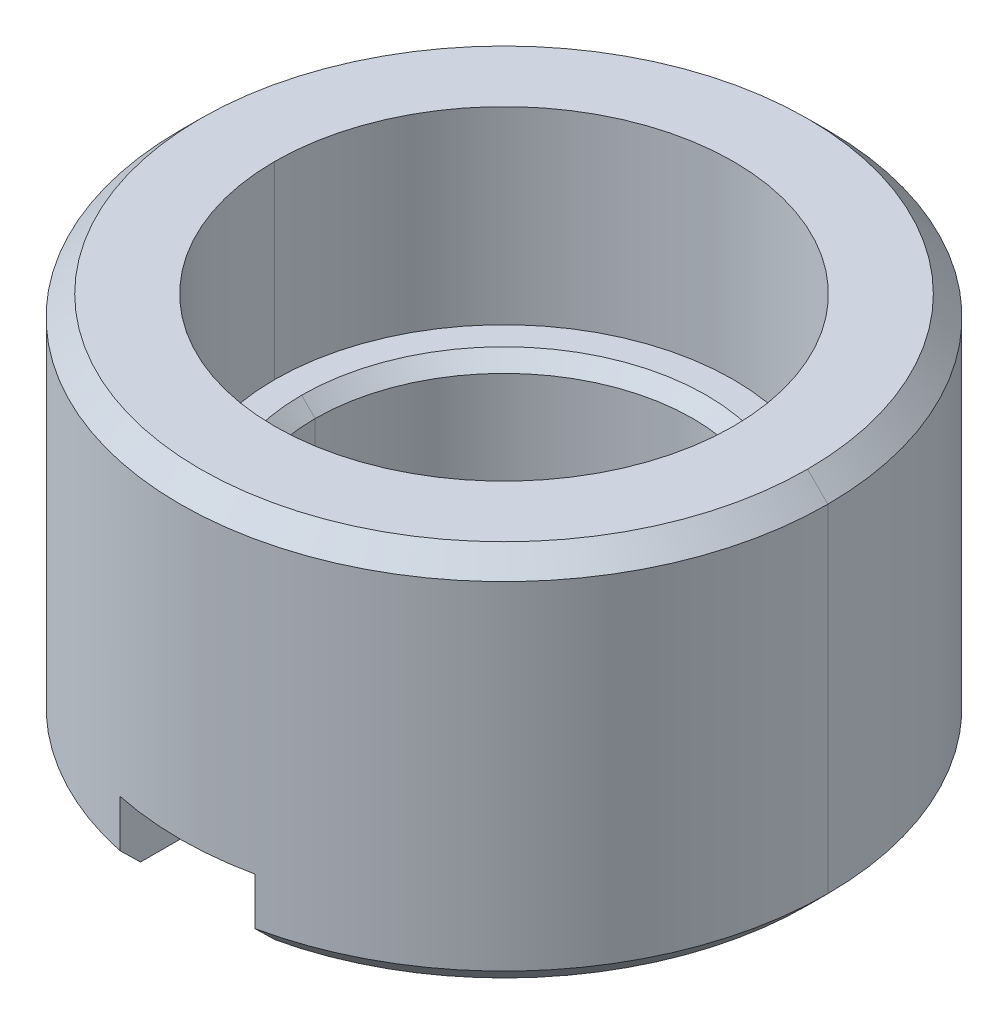
ISO-10303-21;
HEADER;
FILE_DESCRIPTION(('STEP AP214'),'2;1');
FILE_NAME('part.step','',(''),(''),'','','');
FILE_SCHEMA(('AUTOMOTIVE_DESIGN { 1 0 10303 214 1 1 1 1 }'));
ENDSEC;
DATA;
#1=APPLICATION_CONTEXT('core data for automotive mechanical design processes');
#2=APPLICATION_PROTOCOL_DEFINITION('international standard','automotive_design',2000,#1);
#3=PRODUCT_CONTEXT('',#1,'mechanical');
#4=PRODUCT('Part','Part','',(#3));
#5=PRODUCT_RELATED_PRODUCT_CATEGORY('part','',(#4));
#6=PRODUCT_DEFINITION_FORMATION('','',#4);
#7=PRODUCT_DEFINITION_CONTEXT('part definition',#1,'design');
#8=PRODUCT_DEFINITION('design','',#6,#7);
#9=PRODUCT_DEFINITION_SHAPE('','',#8);
#10=(LENGTH_UNIT() NAMED_UNIT(*) SI_UNIT(.MILLI.,.METRE.));
#11=(NAMED_UNIT(*) PLANE_ANGLE_UNIT() SI_UNIT($,.RADIAN.));
#12=(NAMED_UNIT(*) SI_UNIT($,.STERADIAN.) SOLID_ANGLE_UNIT());
#13=UNCERTAINTY_MEASURE_WITH_UNIT(LENGTH_MEASURE(1.E-05),#10,'distance_accuracy_value','');
#14=(GEOMETRIC_REPRESENTATION_CONTEXT(3) GLOBAL_UNCERTAINTY_ASSIGNED_CONTEXT((#13)) GLOBAL_UNIT_ASSIGNED_CONTEXT((#10,
#11,#12)) REPRESENTATION_CONTEXT('',''));
#15=CARTESIAN_POINT('',(0.,0.,0.));
#16=DIRECTION('',(0.,0.,1.));
#17=DIRECTION('',(1.,0.,0.));
#18=AXIS2_PLACEMENT_3D('',#15,#16,#17);
#19=CARTESIAN_POINT('',(0.,2.8,0.));
#20=DIRECTION('',(0.,-1.,0.));
#21=DIRECTION('',(1.,0.,0.));
#22=AXIS2_PLACEMENT_3D('',#19,#20,#21);
#23=CYLINDRICAL_SURFACE('',#22,1.7);
#24=CARTESIAN_POINT('',(0.,2.8,0.));
#25=DIRECTION('',(0.,1.,0.));
#26=DIRECTION('',(1.,0.,0.));
#27=AXIS2_PLACEMENT_3D('',#24,#25,#26);
#28=CIRCLE('',#27,1.7);
#29=CARTESIAN_POINT('',(1.7,2.8,0.));
#30=VERTEX_POINT('',#29);
#31=CARTESIAN_POINT('',(-1.7,2.8,0.));
#32=VERTEX_POINT('',#31);
#33=EDGE_CURVE('E203',#30,#32,#28,.T.);
#34=ORIENTED_EDGE('',*,*,#33,.T.);
#35=DIRECTION('',(0.,-1.,0.));
#36=VECTOR('',#35,1.);
#37=CARTESIAN_POINT('',(-1.7,2.8,0.));
#38=LINE('',#37,#36);
#39=CARTESIAN_POINT('',(-1.7,1.4,0.));
#40=VERTEX_POINT('',#39);
#41=EDGE_CURVE('E26',#32,#40,#38,.T.);
#42=ORIENTED_EDGE('',*,*,#41,.T.);
#43=CARTESIAN_POINT('',(0.,1.4,0.));
#44=DIRECTION('',(0.,-1.,0.));
#45=DIRECTION('',(-1.,0.,0.));
#46=AXIS2_PLACEMENT_3D('',#43,#44,#45);
#47=CIRCLE('',#46,1.7);
#48=CARTESIAN_POINT('',(1.7,1.4,0.));
#49=VERTEX_POINT('',#48);
#50=EDGE_CURVE('E265',#40,#49,#47,.T.);
#51=ORIENTED_EDGE('',*,*,#50,.T.);
#52=DIRECTION('',(0.,-1.,0.));
#53=VECTOR('',#52,1.);
#54=CARTESIAN_POINT('',(1.7,2.8,0.));
#55=LINE('',#54,#53);
#56=EDGE_CURVE('E11',#30,#49,#55,.T.);
#57=ORIENTED_EDGE('',*,*,#56,.F.);
#58=EDGE_LOOP('',(#34,#42,#51,#57));
#59=FACE_BOUND('',#58,.T.);
#60=ADVANCED_FACE('F17',(#59),#23,.F.);
#61=CARTESIAN_POINT('',(0.,2.8,0.));
#62=DIRECTION('',(0.,-1.,0.));
#63=DIRECTION('',(1.,0.,0.));
#64=AXIS2_PLACEMENT_3D('',#61,#62,#63);
#65=CYLINDRICAL_SURFACE('',#64,1.7);
#66=CARTESIAN_POINT('',(0.,1.4,0.));
#67=DIRECTION('',(0.,-1.,0.));
#68=DIRECTION('',(1.,0.,0.));
#69=AXIS2_PLACEMENT_3D('',#66,#67,#68);
#70=CIRCLE('',#69,1.7);
#71=EDGE_CURVE('E196',#49,#40,#70,.T.);
#72=ORIENTED_EDGE('',*,*,#71,.T.);
#73=ORIENTED_EDGE('',*,*,#41,.F.);
#74=CARTESIAN_POINT('',(0.,2.8,0.));
#75=DIRECTION('',(0.,1.,0.));
#76=DIRECTION('',(-1.,0.,0.));
#77=AXIS2_PLACEMENT_3D('',#74,#75,#76);
#78=CIRCLE('',#77,1.7);
#79=EDGE_CURVE('E194',#32,#30,#78,.T.);
#80=ORIENTED_EDGE('',*,*,#79,.T.);
#81=ORIENTED_EDGE('',*,*,#56,.T.);
#82=EDGE_LOOP('',(#72,#73,#80,#81));
#83=FACE_BOUND('',#82,.T.);
#84=ADVANCED_FACE('F193',(#83),#65,.F.);
#85=CARTESIAN_POINT('',(0.,1.4,0.));
#86=DIRECTION('',(0.,-1.,0.));
#87=DIRECTION('',(0.,0.,-1.));
#88=AXIS2_PLACEMENT_3D('',#85,#86,#87);
#89=PLANE('',#88);
#90=CARTESIAN_POINT('',(0.,1.4,0.));
#91=DIRECTION('',(0.,1.,0.));
#92=DIRECTION('',(0.,0.,1.));
#93=AXIS2_PLACEMENT_3D('',#90,#91,#92);
#94=CIRCLE('',#93,1.5);
#95=CARTESIAN_POINT('',(0.,1.4,1.5));
#96=VERTEX_POINT('',#95);
#97=CARTESIAN_POINT('',(1.5,1.4,9.085731393483E-11));
#98=VERTEX_POINT('',#97);
#99=EDGE_CURVE('E251',#96,#98,#94,.T.);
#100=ORIENTED_EDGE('',*,*,#99,.F.);
#101=CARTESIAN_POINT('',(0.,1.4,0.));
#102=DIRECTION('',(0.,1.,0.));
#103=DIRECTION('',(-1.,0.,0.));
#104=AXIS2_PLACEMENT_3D('',#101,#102,#103);
#105=CIRCLE('',#104,1.5);
#106=CARTESIAN_POINT('',(-1.5,1.4,0.));
#107=VERTEX_POINT('',#106);
#108=EDGE_CURVE('E247',#107,#96,#105,.T.);
#109=ORIENTED_EDGE('',*,*,#108,.F.);
#110=CARTESIAN_POINT('',(0.,1.4,0.));
#111=DIRECTION('',(0.,1.,0.));
#112=DIRECTION('',(0.,0.,-1.));
#113=AXIS2_PLACEMENT_3D('',#110,#111,#112);
#114=CIRCLE('',#113,1.5);
#115=CARTESIAN_POINT('',(0.,1.4,-1.5));
#116=VERTEX_POINT('',#115);
#117=EDGE_CURVE('E80',#116,#107,#114,.T.);
#118=ORIENTED_EDGE('',*,*,#117,.F.);
#119=CARTESIAN_POINT('',(0.,1.4,0.));
#120=DIRECTION('',(0.,1.,0.));
#121=DIRECTION('',(1.,0.,0.));
#122=AXIS2_PLACEMENT_3D('',#119,#120,#121);
#123=CIRCLE('',#122,1.5);
#124=EDGE_CURVE('E256',#98,#116,#123,.T.);
#125=ORIENTED_EDGE('',*,*,#124,.F.);
#126=EDGE_LOOP('',(#100,#109,#118,#125));
#127=FACE_BOUND('',#126,.T.);
#128=ORIENTED_EDGE('',*,*,#50,.F.);
#129=ORIENTED_EDGE('',*,*,#71,.F.);
#130=EDGE_LOOP('',(#128,#129));
#131=FACE_BOUND('',#130,.T.);
#132=ADVANCED_FACE('F601',(#127,#131),#89,.F.);
#133=CARTESIAN_POINT('',(0.,0.,0.));
#134=DIRECTION('',(0.,1.,0.));
#135=DIRECTION('',(1.,0.,0.));
#136=AXIS2_PLACEMENT_3D('',#133,#134,#135);
#137=CYLINDRICAL_SURFACE('',#136,1.4);
#138=DIRECTION('',(0.,-1.,6.797527212162E-11));
#139=VECTOR('',#138,1.);
#140=CARTESIAN_POINT('',(-1.4,1.3,-1.98849970225E-11));
#141=LINE('',#140,#139);
#142=CARTESIAN_POINT('',(-1.4,1.3,8.742989173868E-11));
#143=VERTEX_POINT('',#142);
#144=CARTESIAN_POINT('',(-1.4,0.1499999999998,8.742989665578E-11));
#145=VERTEX_POINT('',#144);
#146=EDGE_CURVE('E232',#143,#145,#141,.T.);
#147=ORIENTED_EDGE('',*,*,#146,.T.);
#148=CARTESIAN_POINT('',(0.,0.1499999999998,0.));
#149=DIRECTION('',(0.,-1.,0.));
#150=DIRECTION('',(-1.,0.,6.244992267049E-11));
#151=AXIS2_PLACEMENT_3D('',#148,#149,#150);
#152=CIRCLE('',#151,1.4);
#153=CARTESIAN_POINT('',(0.,0.1499999999998,-1.4));
#154=VERTEX_POINT('',#153);
#155=EDGE_CURVE('E291',#145,#154,#152,.T.);
#156=ORIENTED_EDGE('',*,*,#155,.T.);
#157=CARTESIAN_POINT('',(0.,0.1499999999998,0.));
#158=DIRECTION('',(0.,-1.,0.));
#159=DIRECTION('',(0.,0.,-1.));
#160=AXIS2_PLACEMENT_3D('',#157,#158,#159);
#161=CIRCLE('',#160,1.4);
#162=CARTESIAN_POINT('',(1.4,0.1499999999998,0.));
#163=VERTEX_POINT('',#162);
#164=EDGE_CURVE('E284',#154,#163,#161,.T.);
#165=ORIENTED_EDGE('',*,*,#164,.T.);
#166=DIRECTION('',(0.,-1.,-5.53044333244E-11));
#167=VECTOR('',#166,1.);
#168=CARTESIAN_POINT('',(1.4,1.3,6.360018404834E-11));
#169=LINE('',#168,#167);
#170=CARTESIAN_POINT('',(1.4,1.3,0.));
#171=VERTEX_POINT('',#170);
#172=EDGE_CURVE('E229',#171,#163,#169,.T.);
#173=ORIENTED_EDGE('',*,*,#172,.F.);
#174=CARTESIAN_POINT('',(0.,1.3,0.));
#175=DIRECTION('',(0.,1.,0.));
#176=DIRECTION('',(1.,0.,0.));
#177=AXIS2_PLACEMENT_3D('',#174,#175,#176);
#178=CIRCLE('',#177,1.4);
#179=CARTESIAN_POINT('',(0.,1.3,-1.4));
#180=VERTEX_POINT('',#179);
#181=EDGE_CURVE('E88',#171,#180,#178,.T.);
#182=ORIENTED_EDGE('',*,*,#181,.T.);
#183=CARTESIAN_POINT('',(0.,1.3,0.));
#184=DIRECTION('',(0.,1.,0.));
#185=DIRECTION('',(0.,0.,-1.));
#186=AXIS2_PLACEMENT_3D('',#183,#184,#185);
#187=CIRCLE('',#186,1.4);
#188=EDGE_CURVE('E261',#180,#143,#187,.T.);
#189=ORIENTED_EDGE('',*,*,#188,.T.);
#190=EDGE_LOOP('',(#147,#156,#165,#173,#182,#189));
#191=FACE_BOUND('',#190,.T.);
#192=ADVANCED_FACE('F595',(#191),#137,.F.);
#193=CARTESIAN_POINT('',(0.,1.35,0.));
#194=DIRECTION('',(0.,1.,0.));
#195=DIRECTION('',(0.,0.,-1.));
#196=AXIS2_PLACEMENT_3D('',#193,#194,#195);
#197=CONICAL_SURFACE('',#196,1.45,0.7853981633973);
#198=DIRECTION('',(-0.707106781186548,-0.707106781186548,-1.92737013784213E-10));
#199=VECTOR('',#198,1.);
#200=CARTESIAN_POINT('',(1.5,1.4,9.085731393483E-11));
#201=LINE('',#200,#199);
#202=EDGE_CURVE('E252',#98,#171,#201,.T.);
#203=ORIENTED_EDGE('',*,*,#202,.F.);
#204=ORIENTED_EDGE('',*,*,#124,.T.);
#205=ORIENTED_EDGE('',*,*,#117,.T.);
#206=DIRECTION('',(0.707106781186548,-0.707106781186548,5.01848495559834E-10));
#207=VECTOR('',#206,1.);
#208=CARTESIAN_POINT('',(-1.5,1.4,-9.085709189023E-11));
#209=LINE('',#208,#207);
#210=EDGE_CURVE('E243',#107,#143,#209,.T.);
#211=ORIENTED_EDGE('',*,*,#210,.T.);
#212=ORIENTED_EDGE('',*,*,#188,.F.);
#213=ORIENTED_EDGE('',*,*,#181,.F.);
#214=EDGE_LOOP('',(#203,#204,#205,#211,#212,#213));
#215=FACE_BOUND('',#214,.T.);
#216=ADVANCED_FACE('F600',(#215),#197,.F.);
#217=CARTESIAN_POINT('',(0.,1.35,0.));
#218=DIRECTION('',(0.,1.,0.));
#219=DIRECTION('',(0.,0.,-1.));
#220=AXIS2_PLACEMENT_3D('',#217,#218,#219);
#221=CONICAL_SURFACE('',#220,1.45,0.7853981633973);
#222=ORIENTED_EDGE('',*,*,#210,.F.);
#223=ORIENTED_EDGE('',*,*,#108,.T.);
#224=ORIENTED_EDGE('',*,*,#99,.T.);
#225=ORIENTED_EDGE('',*,*,#202,.T.);
#226=CARTESIAN_POINT('',(0.,1.3,0.));
#227=DIRECTION('',(0.,1.,0.));
#228=DIRECTION('',(0.,0.,1.));
#229=AXIS2_PLACEMENT_3D('',#226,#227,#228);
#230=CIRCLE('',#229,1.4);
#231=CARTESIAN_POINT('',(0.,1.3,1.4));
#232=VERTEX_POINT('',#231);
#233=EDGE_CURVE('E239',#232,#171,#230,.T.);
#234=ORIENTED_EDGE('',*,*,#233,.F.);
#235=CARTESIAN_POINT('',(0.,1.3,0.));
#236=DIRECTION('',(0.,1.,0.));
#237=DIRECTION('',(-1.,0.,6.244992267049E-11));
#238=AXIS2_PLACEMENT_3D('',#235,#236,#237);
#239=CIRCLE('',#238,1.4);
#240=EDGE_CURVE('E235',#143,#232,#239,.T.);
#241=ORIENTED_EDGE('',*,*,#240,.F.);
#242=EDGE_LOOP('',(#222,#223,#224,#225,#234,#241));
#243=FACE_BOUND('',#242,.T.);
#244=ADVANCED_FACE('F643',(#243),#221,.F.);
#245=CARTESIAN_POINT('',(0.,0.,0.));
#246=DIRECTION('',(0.,1.,0.));
#247=DIRECTION('',(1.,0.,0.));
#248=AXIS2_PLACEMENT_3D('',#245,#246,#247);
#249=CYLINDRICAL_SURFACE('',#248,1.4);
#250=ORIENTED_EDGE('',*,*,#172,.T.);
#251=CARTESIAN_POINT('',(0.,0.1499999999998,0.));
#252=DIRECTION('',(0.,-1.,0.));
#253=DIRECTION('',(1.,0.,0.));
#254=AXIS2_PLACEMENT_3D('',#251,#252,#253);
#255=CIRCLE('',#254,1.4);
#256=CARTESIAN_POINT('',(0.4999998127814,0.1500010523687,1.307669754647));
#257=VERTEX_POINT('',#256);
#258=EDGE_CURVE('E292',#163,#257,#255,.T.);
#259=ORIENTED_EDGE('',*,*,#258,.T.);
#260=DIRECTION('',(-5.34911996086019E-07,-0.999999999999836,2.04528388734208E-07));
#261=VECTOR('',#260,1.);
#262=CARTESIAN_POINT('',(0.5,0.5,1.307669683062));
#263=LINE('',#262,#261);
#264=CARTESIAN_POINT('',(0.5,0.5,1.307669683062));
#265=VERTEX_POINT('',#264);
#266=EDGE_CURVE('E389',#265,#257,#263,.T.);
#267=ORIENTED_EDGE('',*,*,#266,.F.);
#268=CARTESIAN_POINT('',(0.,0.5,0.));
#269=DIRECTION('',(0.,-1.,0.));
#270=DIRECTION('',(0.357142857142881,0.,0.93404977361585));
#271=AXIS2_PLACEMENT_3D('',#268,#269,#270);
#272=CIRCLE('',#271,1.4);
#273=CARTESIAN_POINT('',(-0.5,0.5,1.307669683062));
#274=VERTEX_POINT('',#273);
#275=EDGE_CURVE('E226',#265,#274,#272,.T.);
#276=ORIENTED_EDGE('',*,*,#275,.T.);
#277=DIRECTION('',(1.41964306624498E-07,0.999999999999989,5.42816241019194E-08));
#278=VECTOR('',#277,1.);
#279=CARTESIAN_POINT('',(-0.5000000496876,0.1499997207241,1.307669664064));
#280=LINE('',#279,#278);
#281=CARTESIAN_POINT('',(-0.5000000496876,0.1499997207241,1.307669664064));
#282=VERTEX_POINT('',#281);
#283=EDGE_CURVE('E282',#282,#274,#280,.T.);
#284=ORIENTED_EDGE('',*,*,#283,.F.);
#285=CARTESIAN_POINT('',(0.,0.1499999999998,0.));
#286=DIRECTION('',(0.,-1.,0.));
#287=DIRECTION('',(-0.357142857142914,0.,0.934049773615837));
#288=AXIS2_PLACEMENT_3D('',#285,#286,#287);
#289=CIRCLE('',#288,1.4);
#290=EDGE_CURVE('E283',#282,#145,#289,.T.);
#291=ORIENTED_EDGE('',*,*,#290,.T.);
#292=ORIENTED_EDGE('',*,*,#146,.F.);
#293=ORIENTED_EDGE('',*,*,#240,.T.);
#294=ORIENTED_EDGE('',*,*,#233,.T.);
#295=EDGE_LOOP('',(#250,#259,#267,#276,#284,#291,#292,#293,#294));
#296=FACE_BOUND('',#295,.T.);
#297=ADVANCED_FACE('F548',(#296),#249,.F.);
#298=CARTESIAN_POINT('',(0.,0.5,0.));
#299=DIRECTION('',(0.,-1.,0.));
#300=DIRECTION('',(0.,0.,-1.));
#301=AXIS2_PLACEMENT_3D('',#298,#299,#300);
#302=PLANE('',#301);
#303=DIRECTION('',(0.,0.,1.));
#304=VECTOR('',#303,1.);
#305=CARTESIAN_POINT('',(-0.5,0.5,1.307669683062));
#306=LINE('',#305,#304);
#307=CARTESIAN_POINT('',(-0.5,0.5,2.347338918861));
#308=VERTEX_POINT('',#307);
#309=EDGE_CURVE('E302',#274,#308,#306,.T.);
#310=ORIENTED_EDGE('',*,*,#309,.F.);
#311=ORIENTED_EDGE('',*,*,#275,.F.);
#312=DIRECTION('',(0.,0.,-1.));
#313=VECTOR('',#312,1.);
#314=CARTESIAN_POINT('',(0.5,0.5,2.347338918861));
#315=LINE('',#314,#313);
#316=CARTESIAN_POINT('',(0.5,0.5,2.347338918861));
#317=VERTEX_POINT('',#316);
#318=EDGE_CURVE('E403',#317,#265,#315,.T.);
#319=ORIENTED_EDGE('',*,*,#318,.F.);
#320=CARTESIAN_POINT('',(0.,0.5,0.));
#321=DIRECTION('',(0.,1.,0.));
#322=DIRECTION('',(-0.2083333333333,0.,0.978057882858799));
#323=AXIS2_PLACEMENT_3D('',#320,#321,#322);
#324=CIRCLE('',#323,2.4);
#325=EDGE_CURVE('E222',#308,#317,#324,.T.);
#326=ORIENTED_EDGE('',*,*,#325,.F.);
#327=EDGE_LOOP('',(#310,#311,#319,#326));
#328=FACE_BOUND('',#327,.T.);
#329=ADVANCED_FACE('F542',(#328),#302,.T.);
#330=CARTESIAN_POINT('',(0.,0.,0.));
#331=DIRECTION('',(0.,1.,0.));
#332=DIRECTION('',(1.,0.,0.));
#333=AXIS2_PLACEMENT_3D('',#330,#331,#332);
#334=CYLINDRICAL_SURFACE('',#333,2.4);
#335=DIRECTION('',(0.,1.,0.));
#336=VECTOR('',#335,1.);
#337=CARTESIAN_POINT('',(0.5,0.15,2.347338918861));
#338=LINE('',#337,#336);
#339=CARTESIAN_POINT('',(0.5,0.15,2.347338918861));
#340=VERTEX_POINT('',#339);
#341=EDGE_CURVE('E275',#340,#317,#338,.T.);
#342=ORIENTED_EDGE('',*,*,#341,.F.);
#343=CARTESIAN_POINT('',(0.,0.15,0.));
#344=DIRECTION('',(0.,1.,0.));
#345=DIRECTION('',(0.2083333333333,0.,0.978057882858799));
#346=AXIS2_PLACEMENT_3D('',#343,#344,#345);
#347=CIRCLE('',#346,2.4);
#348=CARTESIAN_POINT('',(2.4,0.15,0.));
#349=VERTEX_POINT('',#348);
#350=EDGE_CURVE('E315',#340,#349,#347,.T.);
#351=ORIENTED_EDGE('',*,*,#350,.T.);
#352=DIRECTION('',(0.,-1.,4.526089111671E-11));
#353=VECTOR('',#352,1.);
#354=CARTESIAN_POINT('',(2.4,2.65,-1.131520808341E-10));
#355=LINE('',#354,#353);
#356=CARTESIAN_POINT('',(2.4,2.65,0.));
#357=VERTEX_POINT('',#356);
#358=EDGE_CURVE('E294',#357,#349,#355,.T.);
#359=ORIENTED_EDGE('',*,*,#358,.F.);
#360=CARTESIAN_POINT('',(0.,2.65,0.));
#361=DIRECTION('',(0.,-1.,0.));
#362=DIRECTION('',(1.,0.,0.));
#363=AXIS2_PLACEMENT_3D('',#360,#361,#362);
#364=CIRCLE('',#363,2.4);
#365=CARTESIAN_POINT('',(0.,2.65,2.4));
#366=VERTEX_POINT('',#365);
#367=EDGE_CURVE('E220',#357,#366,#364,.T.);
#368=ORIENTED_EDGE('',*,*,#367,.T.);
#369=CARTESIAN_POINT('',(0.,2.65,0.));
#370=DIRECTION('',(0.,-1.,0.));
#371=DIRECTION('',(0.,0.,1.));
#372=AXIS2_PLACEMENT_3D('',#369,#370,#371);
#373=CIRCLE('',#372,2.4);
#374=CARTESIAN_POINT('',(-2.4,2.65,1.623104042999E-10));
#375=VERTEX_POINT('',#374);
#376=EDGE_CURVE('E205',#366,#375,#373,.T.);
#377=ORIENTED_EDGE('',*,*,#376,.T.);
#378=DIRECTION('',(0.,-1.,-3.44406434167E-11));
#379=VECTOR('',#378,1.);
#380=CARTESIAN_POINT('',(-2.4,2.65,1.943084957558E-10));
#381=LINE('',#380,#379);
#382=CARTESIAN_POINT('',(-2.4,0.15,1.623104042999E-10));
#383=VERTEX_POINT('',#382);
#384=EDGE_CURVE('E297',#375,#383,#381,.T.);
#385=ORIENTED_EDGE('',*,*,#384,.T.);
#386=CARTESIAN_POINT('',(0.,0.15,0.));
#387=DIRECTION('',(0.,1.,0.));
#388=DIRECTION('',(-1.,0.,6.762933512497E-11));
#389=AXIS2_PLACEMENT_3D('',#386,#387,#388);
#390=CIRCLE('',#389,2.4);
#391=CARTESIAN_POINT('',(-0.5,0.15,2.347338918861));
#392=VERTEX_POINT('',#391);
#393=EDGE_CURVE('E322',#383,#392,#390,.T.);
#394=ORIENTED_EDGE('',*,*,#393,.T.);
#395=DIRECTION('',(0.,-1.,0.));
#396=VECTOR('',#395,1.);
#397=CARTESIAN_POINT('',(-0.5,0.5,2.347338918861));
#398=LINE('',#397,#396);
#399=EDGE_CURVE('E306',#308,#392,#398,.T.);
#400=ORIENTED_EDGE('',*,*,#399,.F.);
#401=ORIENTED_EDGE('',*,*,#325,.T.);
#402=EDGE_LOOP('',(#342,#351,#359,#368,#377,#385,#394,#400,#401));
#403=FACE_BOUND('',#402,.T.);
#404=ADVANCED_FACE('F547',(#403),#334,.T.);
#405=CARTESIAN_POINT('',(0.,2.725,0.));
#406=DIRECTION('',(0.,-1.,0.));
#407=DIRECTION('',(0.,0.,-1.));
#408=AXIS2_PLACEMENT_3D('',#405,#406,#407);
#409=CONICAL_SURFACE('',#408,2.325,0.7853981633973);
#410=DIRECTION('',(0.707106781186548,0.707106781186548,-2.49217072912217E-10));
#411=VECTOR('',#410,1.);
#412=CARTESIAN_POINT('',(-2.4,2.65,1.943084957558E-10));
#413=LINE('',#412,#411);
#414=CARTESIAN_POINT('',(-2.25,2.8,0.));
#415=VERTEX_POINT('',#414);
#416=EDGE_CURVE('E335',#375,#415,#413,.T.);
#417=ORIENTED_EDGE('',*,*,#416,.F.);
#418=ORIENTED_EDGE('',*,*,#376,.F.);
#419=ORIENTED_EDGE('',*,*,#367,.F.);
#420=DIRECTION('',(-0.707106781186548,0.707106781186548,-1.33351655570709E-10));
#421=VECTOR('',#420,1.);
#422=CARTESIAN_POINT('',(2.4,2.65,-1.131520808341E-10));
#423=LINE('',#422,#421);
#424=CARTESIAN_POINT('',(2.25,2.8,0.));
#425=VERTEX_POINT('',#424);
#426=EDGE_CURVE('E331',#357,#425,#423,.T.);
#427=ORIENTED_EDGE('',*,*,#426,.T.);
#428=CARTESIAN_POINT('',(0.,2.8,0.));
#429=DIRECTION('',(0.,-1.,0.));
#430=DIRECTION('',(1.,0.,0.));
#431=AXIS2_PLACEMENT_3D('',#428,#429,#430);
#432=CIRCLE('',#431,2.25);
#433=CARTESIAN_POINT('',(0.,2.8,2.25));
#434=VERTEX_POINT('',#433);
#435=EDGE_CURVE('E208',#425,#434,#432,.T.);
#436=ORIENTED_EDGE('',*,*,#435,.T.);
#437=CARTESIAN_POINT('',(0.,2.8,0.));
#438=DIRECTION('',(0.,-1.,0.));
#439=DIRECTION('',(0.,0.,1.));
#440=AXIS2_PLACEMENT_3D('',#437,#438,#439);
#441=CIRCLE('',#440,2.25);
#442=EDGE_CURVE('E214',#434,#415,#441,.T.);
#443=ORIENTED_EDGE('',*,*,#442,.T.);
#444=EDGE_LOOP('',(#417,#418,#419,#427,#436,#443));
#445=FACE_BOUND('',#444,.T.);
#446=ADVANCED_FACE('F351',(#445),#409,.T.);
#447=CARTESIAN_POINT('',(0.,2.8,0.));
#448=DIRECTION('',(0.,1.,0.));
#449=DIRECTION('',(1.,0.,0.));
#450=AXIS2_PLACEMENT_3D('',#447,#448,#449);
#451=PLANE('',#450);
#452=ORIENTED_EDGE('',*,*,#33,.F.);
#453=ORIENTED_EDGE('',*,*,#79,.F.);
#454=EDGE_LOOP('',(#452,#453));
#455=FACE_BOUND('',#454,.T.);
#456=ORIENTED_EDGE('',*,*,#442,.F.);
#457=ORIENTED_EDGE('',*,*,#435,.F.);
#458=CARTESIAN_POINT('',(0.,2.8,0.));
#459=DIRECTION('',(0.,-1.,0.));
#460=DIRECTION('',(0.,0.,-1.));
#461=AXIS2_PLACEMENT_3D('',#458,#459,#460);
#462=CIRCLE('',#461,2.25);
#463=CARTESIAN_POINT('',(0.,2.8,-2.25));
#464=VERTEX_POINT('',#463);
#465=EDGE_CURVE('E342',#464,#425,#462,.T.);
#466=ORIENTED_EDGE('',*,*,#465,.F.);
#467=CARTESIAN_POINT('',(0.,2.8,0.));
#468=DIRECTION('',(0.,-1.,0.));
#469=DIRECTION('',(-1.,0.,0.));
#470=AXIS2_PLACEMENT_3D('',#467,#468,#469);
#471=CIRCLE('',#470,2.25);
#472=EDGE_CURVE('E339',#415,#464,#471,.T.);
#473=ORIENTED_EDGE('',*,*,#472,.F.);
#474=EDGE_LOOP('',(#456,#457,#466,#473));
#475=FACE_BOUND('',#474,.T.);
#476=ADVANCED_FACE('F201',(#455,#475),#451,.T.);
#477=CARTESIAN_POINT('',(0.,2.725,0.));
#478=DIRECTION('',(0.,-1.,0.));
#479=DIRECTION('',(0.,0.,-1.));
#480=AXIS2_PLACEMENT_3D('',#477,#478,#479);
#481=CONICAL_SURFACE('',#480,2.325,0.7853981633973);
#482=ORIENTED_EDGE('',*,*,#426,.F.);
#483=CARTESIAN_POINT('',(0.,2.65,0.));
#484=DIRECTION('',(0.,-1.,0.));
#485=DIRECTION('',(0.,0.,-1.));
#486=AXIS2_PLACEMENT_3D('',#483,#484,#485);
#487=CIRCLE('',#486,2.4);
#488=CARTESIAN_POINT('',(0.,2.65,-2.4));
#489=VERTEX_POINT('',#488);
#490=EDGE_CURVE('E327',#489,#357,#487,.T.);
#491=ORIENTED_EDGE('',*,*,#490,.F.);
#492=CARTESIAN_POINT('',(0.,2.65,0.));
#493=DIRECTION('',(0.,-1.,0.));
#494=DIRECTION('',(-1.,0.,6.762933512497E-11));
#495=AXIS2_PLACEMENT_3D('',#492,#493,#494);
#496=CIRCLE('',#495,2.4);
#497=EDGE_CURVE('E323',#375,#489,#496,.T.);
#498=ORIENTED_EDGE('',*,*,#497,.F.);
#499=ORIENTED_EDGE('',*,*,#416,.T.);
#500=ORIENTED_EDGE('',*,*,#472,.T.);
#501=ORIENTED_EDGE('',*,*,#465,.T.);
#502=EDGE_LOOP('',(#482,#491,#498,#499,#500,#501));
#503=FACE_BOUND('',#502,.T.);
#504=ADVANCED_FACE('F356',(#503),#481,.T.);
#505=CARTESIAN_POINT('',(0.,0.,0.));
#506=DIRECTION('',(0.,1.,0.));
#507=DIRECTION('',(1.,0.,0.));
#508=AXIS2_PLACEMENT_3D('',#505,#506,#507);
#509=CYLINDRICAL_SURFACE('',#508,2.4);
#510=ORIENTED_EDGE('',*,*,#358,.T.);
#511=CARTESIAN_POINT('',(0.,0.15,0.));
#512=DIRECTION('',(0.,1.,0.));
#513=DIRECTION('',(1.,0.,0.));
#514=AXIS2_PLACEMENT_3D('',#511,#512,#513);
#515=CIRCLE('',#514,2.4);
#516=CARTESIAN_POINT('',(0.,0.15,-2.4));
#517=VERTEX_POINT('',#516);
#518=EDGE_CURVE('E298',#349,#517,#515,.T.);
#519=ORIENTED_EDGE('',*,*,#518,.T.);
#520=CARTESIAN_POINT('',(0.,0.15,0.));
#521=DIRECTION('',(0.,1.,0.));
#522=DIRECTION('',(0.,0.,-1.));
#523=AXIS2_PLACEMENT_3D('',#520,#521,#522);
#524=CIRCLE('',#523,2.4);
#525=EDGE_CURVE('E362',#517,#383,#524,.T.);
#526=ORIENTED_EDGE('',*,*,#525,.T.);
#527=ORIENTED_EDGE('',*,*,#384,.F.);
#528=ORIENTED_EDGE('',*,*,#497,.T.);
#529=ORIENTED_EDGE('',*,*,#490,.T.);
#530=EDGE_LOOP('',(#510,#519,#526,#527,#528,#529));
#531=FACE_BOUND('',#530,.T.);
#532=ADVANCED_FACE('F360',(#531),#509,.T.);
#533=CARTESIAN_POINT('',(0.,0.075,0.));
#534=DIRECTION('',(0.,1.,0.));
#535=DIRECTION('',(0.,0.,-1.));
#536=AXIS2_PLACEMENT_3D('',#533,#534,#535);
#537=CONICAL_SURFACE('',#536,2.325,0.7853981633973);
#538=ORIENTED_EDGE('',*,*,#350,.F.);
#539=CARTESIAN_POINT('',(0.5,0.,2.193741096848));
#540=CARTESIAN_POINT('',(0.5,0.01665712900729,2.210825401063));
#541=CARTESIAN_POINT('',(0.5,0.04997924865531,2.244980624754));
#542=CARTESIAN_POINT('',(0.5,0.09998006566984,2.296179150783));
#543=CARTESIAN_POINT('',(0.5,0.1333246974008,2.330289516273));
#544=CARTESIAN_POINT('',(0.5,0.15,2.347338918861));
#545=(BOUNDED_CURVE() B_SPLINE_CURVE(3,(#539,#540,#541,#542,#543,#544),.UNSPECIFIED.,.F.,
.F.) B_SPLINE_CURVE_WITH_KNOTS((4,1,1,4),(0.,0.3333333333333,0.6666666666667,1.),
.UNSPECIFIED.) CURVE() GEOMETRIC_REPRESENTATION_ITEM() RATIONAL_B_SPLINE_CURVE((1.,1.,1.,1.,1.,1.)) REPRESENTATION_ITEM(''));
#546=CARTESIAN_POINT('',(0.5,0.,2.193741096848));
#547=VERTEX_POINT('',#546);
#548=EDGE_CURVE('E374',#547,#340,#545,.T.);
#549=ORIENTED_EDGE('',*,*,#548,.F.);
#550=CARTESIAN_POINT('',(0.,0.,0.));
#551=DIRECTION('',(0.,1.,0.));
#552=DIRECTION('',(0.222222222222195,0.,0.974996043043575));
#553=AXIS2_PLACEMENT_3D('',#550,#551,#552);
#554=CIRCLE('',#553,2.25);
#555=CARTESIAN_POINT('',(0.,0.,-2.25));
#556=VERTEX_POINT('',#555);
#557=EDGE_CURVE('E395',#547,#556,#554,.T.);
#558=ORIENTED_EDGE('',*,*,#557,.T.);
#559=CARTESIAN_POINT('',(0.,0.,0.));
#560=DIRECTION('',(0.,1.,0.));
#561=DIRECTION('',(0.,0.,-1.));
#562=AXIS2_PLACEMENT_3D('',#559,#560,#561);
#563=CIRCLE('',#562,2.25);
#564=CARTESIAN_POINT('',(-0.5,0.,2.193741096848));
#565=VERTEX_POINT('',#564);
#566=EDGE_CURVE('E398',#556,#565,#563,.T.);
#567=ORIENTED_EDGE('',*,*,#566,.T.);
#568=CARTESIAN_POINT('',(-0.5,0.15,2.347338918861));
#569=CARTESIAN_POINT('',(-0.5,0.1333246974006,2.330289516273));
#570=CARTESIAN_POINT('',(-0.5,0.09998006566938,2.296179150783));
#571=CARTESIAN_POINT('',(-0.5,0.04997924865485,2.244980624754));
#572=CARTESIAN_POINT('',(-0.5,0.0166571290071,2.210825401062));
#573=CARTESIAN_POINT('',(-0.5,0.,2.193741096848));
#574=(BOUNDED_CURVE() B_SPLINE_CURVE(3,(#568,#569,#570,#571,#572,#573),.UNSPECIFIED.,.F.,
.F.) B_SPLINE_CURVE_WITH_KNOTS((4,1,1,4),(0.,0.3333333333333,0.6666666666667,1.),
.UNSPECIFIED.) CURVE() GEOMETRIC_REPRESENTATION_ITEM() RATIONAL_B_SPLINE_CURVE((1.,1.,1.,1.,1.,1.)) REPRESENTATION_ITEM(''));
#575=EDGE_CURVE('E310',#392,#565,#574,.T.);
#576=ORIENTED_EDGE('',*,*,#575,.F.);
#577=ORIENTED_EDGE('',*,*,#393,.F.);
#578=ORIENTED_EDGE('',*,*,#525,.F.);
#579=ORIENTED_EDGE('',*,*,#518,.F.);
#580=EDGE_LOOP('',(#538,#549,#558,#567,#576,#577,#578,#579));
#581=FACE_BOUND('',#580,.T.);
#582=ADVANCED_FACE('F610',(#581),#537,.T.);
#583=CARTESIAN_POINT('',(-0.5,0.,3.));
#584=DIRECTION('',(-1.,0.,0.));
#585=DIRECTION('',(0.,0.,1.));
#586=AXIS2_PLACEMENT_3D('',#583,#584,#585);
#587=PLANE('',#586);
#588=CARTESIAN_POINT('',(-0.5000000496876,0.1499997207241,1.307669664064));
#589=CARTESIAN_POINT('',(-0.5000000496876,0.1333952020892,1.325446574703));
#590=CARTESIAN_POINT('',(-0.4999999998529,0.1001367662004,1.360955106626));
#591=CARTESIAN_POINT('',(-0.4999999259835,0.05013986903519,1.414114748257));
#592=CARTESIAN_POINT('',(-0.5000001728033,0.01672136616156,1.449473141671));
#593=CARTESIAN_POINT('',(-0.5000001728033,0.,1.467138885461));
#594=(BOUNDED_CURVE() B_SPLINE_CURVE(3,(#588,#589,#590,#591,#592,#593),.UNSPECIFIED.,.F.,
.F.) B_SPLINE_CURVE_WITH_KNOTS((4,1,1,4),(0.,0.3333333333333,0.6666666666667,1.),
.UNSPECIFIED.) CURVE() GEOMETRIC_REPRESENTATION_ITEM() RATIONAL_B_SPLINE_CURVE((1.,1.,1.,1.,1.,1.)) REPRESENTATION_ITEM(''));
#595=CARTESIAN_POINT('',(-0.5000001728033,0.,1.467138885461));
#596=VERTEX_POINT('',#595);
#597=EDGE_CURVE('E277',#282,#596,#594,.T.);
#598=ORIENTED_EDGE('',*,*,#597,.F.);
#599=ORIENTED_EDGE('',*,*,#283,.T.);
#600=ORIENTED_EDGE('',*,*,#309,.T.);
#601=ORIENTED_EDGE('',*,*,#399,.T.);
#602=ORIENTED_EDGE('',*,*,#575,.T.);
#603=DIRECTION('',(2.37823790530694E-07,0.,0.999999999999972));
#604=VECTOR('',#603,1.);
#605=CARTESIAN_POINT('',(-0.5000001728033,0.,1.467138885461));
#606=LINE('',#605,#604);
#607=EDGE_CURVE('E402',#596,#565,#606,.T.);
#608=ORIENTED_EDGE('',*,*,#607,.F.);
#609=EDGE_LOOP('',(#598,#599,#600,#601,#602,#608));
#610=FACE_BOUND('',#609,.T.);
#611=ADVANCED_FACE('F588',(#610),#587,.F.);
#612=CARTESIAN_POINT('',(0.,0.0749999999998,0.));
#613=DIRECTION('',(0.,-1.,0.));
#614=DIRECTION('',(0.,0.,-1.));
#615=AXIS2_PLACEMENT_3D('',#612,#613,#614);
#616=CONICAL_SURFACE('',#615,1.475,0.7853981633973);
#617=CARTESIAN_POINT('',(0.4999999594,0.,1.46714035464));
#618=CARTESIAN_POINT('',(0.4999999594,0.01672241034467,1.449473510321));
#619=CARTESIAN_POINT('',(0.4999999939842,0.05013661258073,1.41411206201));
#620=CARTESIAN_POINT('',(0.5000000819554,0.1001339143277,1.360952016996));
#621=CARTESIAN_POINT('',(0.4999998127814,0.1333956036131,1.325447657386));
#622=CARTESIAN_POINT('',(0.4999998127814,0.1500010523687,1.307669754647));
#623=(BOUNDED_CURVE() B_SPLINE_CURVE(3,(#617,#618,#619,#620,#621,#622),.UNSPECIFIED.,.F.,
.F.) B_SPLINE_CURVE_WITH_KNOTS((4,1,1,4),(0.,0.3333333333333,0.6666666666667,1.),
.UNSPECIFIED.) CURVE() GEOMETRIC_REPRESENTATION_ITEM() RATIONAL_B_SPLINE_CURVE((1.,1.,1.,1.,1.,1.)) REPRESENTATION_ITEM(''));
#624=CARTESIAN_POINT('',(0.4999999594,0.,1.46714035464));
#625=VERTEX_POINT('',#624);
#626=EDGE_CURVE('E370',#625,#257,#623,.T.);
#627=ORIENTED_EDGE('',*,*,#626,.T.);
#628=ORIENTED_EDGE('',*,*,#258,.F.);
#629=ORIENTED_EDGE('',*,*,#164,.F.);
#630=ORIENTED_EDGE('',*,*,#155,.F.);
#631=ORIENTED_EDGE('',*,*,#290,.F.);
#632=ORIENTED_EDGE('',*,*,#597,.T.);
#633=CARTESIAN_POINT('',(0.,-1.95399252334E-13,0.));
#634=DIRECTION('',(0.,-1.,0.));
#635=DIRECTION('',(-0.3225806451613,0.,0.946541983943301));
#636=AXIS2_PLACEMENT_3D('',#633,#634,#635);
#637=CIRCLE('',#636,1.55);
#638=CARTESIAN_POINT('',(0.,-1.95399252334E-13,-1.55));
#639=VERTEX_POINT('',#638);
#640=EDGE_CURVE('E410',#596,#639,#637,.T.);
#641=ORIENTED_EDGE('',*,*,#640,.T.);
#642=CARTESIAN_POINT('',(0.,-1.95399252334E-13,0.));
#643=DIRECTION('',(0.,-1.,0.));
#644=DIRECTION('',(0.,0.,-1.));
#645=AXIS2_PLACEMENT_3D('',#642,#643,#644);
#646=CIRCLE('',#645,1.55);
#647=EDGE_CURVE('E419',#639,#625,#646,.T.);
#648=ORIENTED_EDGE('',*,*,#647,.T.);
#649=EDGE_LOOP('',(#627,#628,#629,#630,#631,#632,#641,#648));
#650=FACE_BOUND('',#649,.T.);
#651=ADVANCED_FACE('F571',(#650),#616,.F.);
#652=CARTESIAN_POINT('',(0.5,0.,0.));
#653=DIRECTION('',(1.,0.,0.));
#654=DIRECTION('',(0.,1.,0.));
#655=AXIS2_PLACEMENT_3D('',#652,#653,#654);
#656=PLANE('',#655);
#657=ORIENTED_EDGE('',*,*,#548,.T.);
#658=ORIENTED_EDGE('',*,*,#341,.T.);
#659=ORIENTED_EDGE('',*,*,#318,.T.);
#660=ORIENTED_EDGE('',*,*,#266,.T.);
#661=ORIENTED_EDGE('',*,*,#626,.F.);
#662=DIRECTION('',(5.58766189650999E-08,0.,1.));
#663=VECTOR('',#662,1.);
#664=CARTESIAN_POINT('',(0.4999999594,0.,1.46714035464));
#665=LINE('',#664,#663);
#666=EDGE_CURVE('E380',#625,#547,#665,.T.);
#667=ORIENTED_EDGE('',*,*,#666,.T.);
#668=EDGE_LOOP('',(#657,#658,#659,#660,#661,#667));
#669=FACE_BOUND('',#668,.T.);
#670=ADVANCED_FACE('F561',(#669),#656,.F.);
#671=CARTESIAN_POINT('',(0.,0.,0.));
#672=DIRECTION('',(0.,1.,0.));
#673=DIRECTION('',(1.,0.,0.));
#674=AXIS2_PLACEMENT_3D('',#671,#672,#673);
#675=PLANE('',#674);
#676=ORIENTED_EDGE('',*,*,#647,.F.);
#677=ORIENTED_EDGE('',*,*,#640,.F.);
#678=ORIENTED_EDGE('',*,*,#607,.T.);
#679=ORIENTED_EDGE('',*,*,#566,.F.);
#680=ORIENTED_EDGE('',*,*,#557,.F.);
#681=ORIENTED_EDGE('',*,*,#666,.F.);
#682=EDGE_LOOP('',(#676,#677,#678,#679,#680,#681));
#683=FACE_BOUND('',#682,.T.);
#684=ADVANCED_FACE('F556',(#683),#675,.F.);
#685=CLOSED_SHELL('',(#60,#84,#132,#192,#216,#244,#297,#329,#404,#446,#476,#504,#532,#582,#611,
#651,#670,#684));
#686=MANIFOLD_SOLID_BREP('B1',#685);
#687=ADVANCED_BREP_SHAPE_REPRESENTATION('',(#18,#686),#14);
#688=SHAPE_DEFINITION_REPRESENTATION(#9,#687);
ENDSEC;
END-ISO-10303-21;
